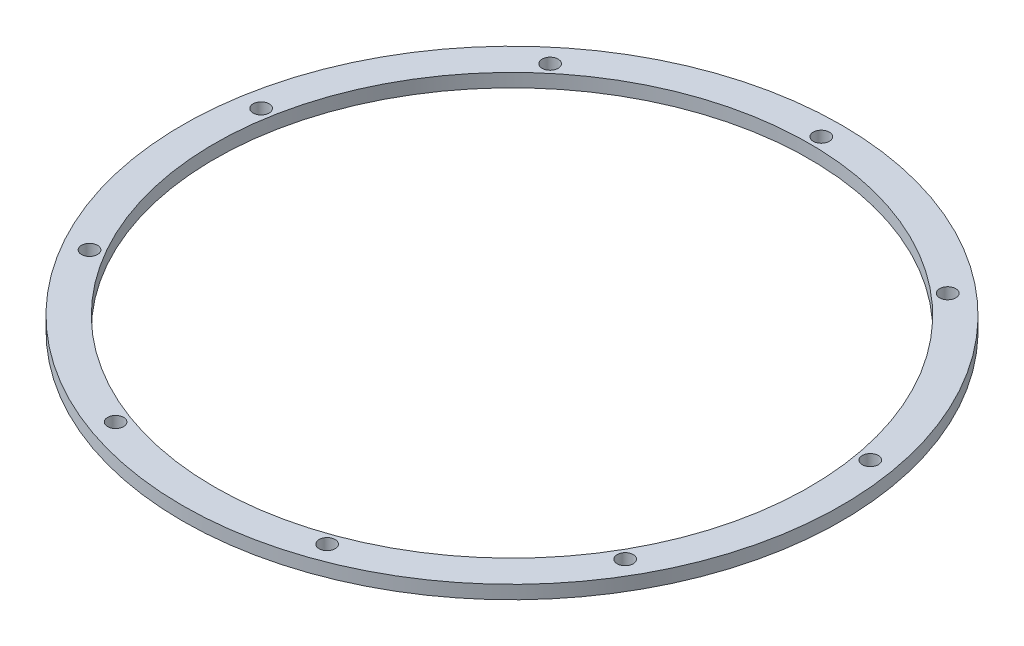
ISO-10303-21;
HEADER;
FILE_DESCRIPTION(('STEP AP214'),'2;1');
FILE_NAME('part.step','',(''),(''),'','','');
FILE_SCHEMA(('AUTOMOTIVE_DESIGN { 1 0 10303 214 1 1 1 1 }'));
ENDSEC;
DATA;
#1=APPLICATION_CONTEXT('core data for automotive mechanical design processes');
#2=APPLICATION_PROTOCOL_DEFINITION('international standard','automotive_design',2000,#1);
#3=PRODUCT_CONTEXT('',#1,'mechanical');
#4=PRODUCT('Part','Part','',(#3));
#5=PRODUCT_RELATED_PRODUCT_CATEGORY('part','',(#4));
#6=PRODUCT_DEFINITION_FORMATION('','',#4);
#7=PRODUCT_DEFINITION_CONTEXT('part definition',#1,'design');
#8=PRODUCT_DEFINITION('design','',#6,#7);
#9=PRODUCT_DEFINITION_SHAPE('','',#8);
#10=(LENGTH_UNIT() NAMED_UNIT(*) SI_UNIT(.MILLI.,.METRE.));
#11=(NAMED_UNIT(*) PLANE_ANGLE_UNIT() SI_UNIT($,.RADIAN.));
#12=(NAMED_UNIT(*) SI_UNIT($,.STERADIAN.) SOLID_ANGLE_UNIT());
#13=UNCERTAINTY_MEASURE_WITH_UNIT(LENGTH_MEASURE(1.E-05),#10,'distance_accuracy_value','');
#14=(GEOMETRIC_REPRESENTATION_CONTEXT(3) GLOBAL_UNCERTAINTY_ASSIGNED_CONTEXT((#13)) GLOBAL_UNIT_ASSIGNED_CONTEXT((#10,
#11,#12)) REPRESENTATION_CONTEXT('',''));
#15=CARTESIAN_POINT('',(0.,0.,0.));
#16=DIRECTION('',(0.,0.,1.));
#17=DIRECTION('',(1.,0.,0.));
#18=AXIS2_PLACEMENT_3D('',#15,#16,#17);
#19=CARTESIAN_POINT('',(0.,5.,0.));
#20=DIRECTION('',(0.,1.,0.));
#21=DIRECTION('',(0.,0.,1.));
#22=AXIS2_PLACEMENT_3D('',#19,#20,#21);
#23=PLANE('',#22);
#24=CARTESIAN_POINT('',(-113.745295472906,5.,-20.0563645205256));
#25=DIRECTION('',(0.,1.,0.));
#26=DIRECTION('',(0.,0.,1.));
#27=AXIS2_PLACEMENT_3D('',#24,#25,#26);
#28=CIRCLE('',#27,3.00000000000647);
#29=CARTESIAN_POINT('',(-113.745295472906,5.,-17.0563645205191));
#30=VERTEX_POINT('',#29);
#31=EDGE_CURVE('E102',#30,#30,#28,.T.);
#32=ORIENTED_EDGE('',*,*,#31,.F.);
#33=EDGE_LOOP('',(#32));
#34=FACE_BOUND('',#33,.T.);
#35=CARTESIAN_POINT('',(-39.5033265541052,5.,108.534497700774));
#36=DIRECTION('',(0.,1.,0.));
#37=DIRECTION('',(0.,0.,1.));
#38=AXIS2_PLACEMENT_3D('',#35,#36,#37);
#39=CIRCLE('',#38,3.00000000001042);
#40=CARTESIAN_POINT('',(-39.5033265541052,5.,111.534497700785));
#41=VERTEX_POINT('',#40);
#42=EDGE_CURVE('E90',#41,#41,#39,.T.);
#43=ORIENTED_EDGE('',*,*,#42,.F.);
#44=EDGE_LOOP('',(#43));
#45=FACE_BOUND('',#44,.T.);
#46=CARTESIAN_POINT('',(100.02593413711,5.,57.7499999999957));
#47=DIRECTION('',(0.,1.,0.));
#48=DIRECTION('',(0.,0.,1.));
#49=AXIS2_PLACEMENT_3D('',#46,#47,#48);
#50=CIRCLE('',#49,3.00000000000633);
#51=CARTESIAN_POINT('',(100.02593413711,5.,60.7500000000021));
#52=VERTEX_POINT('',#51);
#53=EDGE_CURVE('E78',#52,#52,#50,.T.);
#54=ORIENTED_EDGE('',*,*,#53,.F.);
#55=EDGE_LOOP('',(#54));
#56=FACE_BOUND('',#55,.T.);
#57=CARTESIAN_POINT('',(74.2419689187964,5.,-88.4781331802451));
#58=DIRECTION('',(0.,1.,0.));
#59=DIRECTION('',(0.,0.,1.));
#60=AXIS2_PLACEMENT_3D('',#57,#58,#59);
#61=CIRCLE('',#60,3.00000000000036);
#62=CARTESIAN_POINT('',(74.2419689187964,5.,-85.4781331802448));
#63=VERTEX_POINT('',#62);
#64=EDGE_CURVE('E66',#63,#63,#61,.T.);
#65=ORIENTED_EDGE('',*,*,#64,.F.);
#66=EDGE_LOOP('',(#65));
#67=FACE_BOUND('',#66,.T.);
#68=CARTESIAN_POINT('',(0.,5.,0.));
#69=DIRECTION('',(0.,1.,0.));
#70=DIRECTION('',(0.,0.,1.));
#71=AXIS2_PLACEMENT_3D('',#68,#69,#70);
#72=CIRCLE('',#71,111.1);
#73=CARTESIAN_POINT('',(0.,5.,111.1));
#74=VERTEX_POINT('',#73);
#75=EDGE_CURVE('E55',#74,#74,#72,.T.);
#76=ORIENTED_EDGE('',*,*,#75,.F.);
#77=EDGE_LOOP('',(#76));
#78=FACE_BOUND('',#77,.T.);
#79=CARTESIAN_POINT('',(0.,5.,0.));
#80=DIRECTION('',(0.,1.,0.));
#81=DIRECTION('',(0.,0.,1.));
#82=AXIS2_PLACEMENT_3D('',#79,#80,#81);
#83=CIRCLE('',#82,123.075);
#84=CARTESIAN_POINT('',(0.,5.,123.075));
#85=VERTEX_POINT('',#84);
#86=EDGE_CURVE('E12',#85,#85,#83,.T.);
#87=ORIENTED_EDGE('',*,*,#86,.T.);
#88=EDGE_LOOP('',(#87));
#89=FACE_BOUND('',#88,.T.);
#90=CARTESIAN_POINT('',(0.,5.,-115.5));
#91=DIRECTION('',(0.,1.,0.));
#92=DIRECTION('',(0.,0.,1.));
#93=AXIS2_PLACEMENT_3D('',#90,#91,#92);
#94=CIRCLE('',#93,3.);
#95=CARTESIAN_POINT('',(0.,5.,-112.5));
#96=VERTEX_POINT('',#95);
#97=EDGE_CURVE('E60',#96,#96,#94,.T.);
#98=ORIENTED_EDGE('',*,*,#97,.F.);
#99=EDGE_LOOP('',(#98));
#100=FACE_BOUND('',#99,.T.);
#101=CARTESIAN_POINT('',(113.745295472914,5.,-20.0563645205353));
#102=DIRECTION('',(0.,1.,0.));
#103=DIRECTION('',(0.,0.,1.));
#104=AXIS2_PLACEMENT_3D('',#101,#102,#103);
#105=CIRCLE('',#104,3.00000000000281);
#106=CARTESIAN_POINT('',(113.745295472914,5.,-17.0563645205325));
#107=VERTEX_POINT('',#106);
#108=EDGE_CURVE('E72',#107,#107,#105,.T.);
#109=ORIENTED_EDGE('',*,*,#108,.F.);
#110=EDGE_LOOP('',(#109));
#111=FACE_BOUND('',#110,.T.);
#112=CARTESIAN_POINT('',(39.5033265541243,5.,108.534497700771));
#113=DIRECTION('',(0.,1.,0.));
#114=DIRECTION('',(0.,0.,1.));
#115=AXIS2_PLACEMENT_3D('',#112,#113,#114);
#116=CIRCLE('',#115,3.0000000000093);
#117=CARTESIAN_POINT('',(39.5033265541243,5.,111.53449770078));
#118=VERTEX_POINT('',#117);
#119=EDGE_CURVE('E84',#118,#118,#116,.T.);
#120=ORIENTED_EDGE('',*,*,#119,.F.);
#121=EDGE_LOOP('',(#120));
#122=FACE_BOUND('',#121,.T.);
#123=CARTESIAN_POINT('',(-100.025934137095,5.,57.7500000000043));
#124=DIRECTION('',(0.,1.,0.));
#125=DIRECTION('',(0.,0.,1.));
#126=AXIS2_PLACEMENT_3D('',#123,#124,#125);
#127=CIRCLE('',#126,3.00000000000937);
#128=CARTESIAN_POINT('',(-100.025934137095,5.,60.7500000000137));
#129=VERTEX_POINT('',#128);
#130=EDGE_CURVE('E96',#129,#129,#127,.T.);
#131=ORIENTED_EDGE('',*,*,#130,.F.);
#132=EDGE_LOOP('',(#131));
#133=FACE_BOUND('',#132,.T.);
#134=CARTESIAN_POINT('',(-74.2419689187942,5.,-88.4781331802388));
#135=DIRECTION('',(0.,1.,0.));
#136=DIRECTION('',(0.,0.,1.));
#137=AXIS2_PLACEMENT_3D('',#134,#135,#136);
#138=CIRCLE('',#137,3.00000000000341);
#139=CARTESIAN_POINT('',(-74.2419689187942,5.,-85.4781331802354));
#140=VERTEX_POINT('',#139);
#141=EDGE_CURVE('E108',#140,#140,#138,.T.);
#142=ORIENTED_EDGE('',*,*,#141,.F.);
#143=EDGE_LOOP('',(#142));
#144=FACE_BOUND('',#143,.T.);
#145=ADVANCED_FACE('F44',(#34,#45,#56,#67,#78,#89,#100,#111,#122,#133,#144),#23,.T.);
#146=CARTESIAN_POINT('',(0.,0.,0.));
#147=DIRECTION('',(0.,1.,0.));
#148=DIRECTION('',(0.,0.,1.));
#149=AXIS2_PLACEMENT_3D('',#146,#147,#148);
#150=PLANE('',#149);
#151=CARTESIAN_POINT('',(0.,0.,0.));
#152=DIRECTION('',(0.,1.,0.));
#153=DIRECTION('',(0.,0.,1.));
#154=AXIS2_PLACEMENT_3D('',#151,#152,#153);
#155=CIRCLE('',#154,123.075);
#156=CARTESIAN_POINT('',(0.,0.,123.075));
#157=VERTEX_POINT('',#156);
#158=EDGE_CURVE('E48',#157,#157,#155,.T.);
#159=ORIENTED_EDGE('',*,*,#158,.F.);
#160=EDGE_LOOP('',(#159));
#161=FACE_BOUND('',#160,.T.);
#162=CARTESIAN_POINT('',(0.,0.,0.));
#163=DIRECTION('',(0.,1.,0.));
#164=DIRECTION('',(0.,0.,1.));
#165=AXIS2_PLACEMENT_3D('',#162,#163,#164);
#166=CIRCLE('',#165,111.1);
#167=CARTESIAN_POINT('',(0.,0.,111.1));
#168=VERTEX_POINT('',#167);
#169=EDGE_CURVE('E57',#168,#168,#166,.T.);
#170=ORIENTED_EDGE('',*,*,#169,.T.);
#171=EDGE_LOOP('',(#170));
#172=FACE_BOUND('',#171,.T.);
#173=CARTESIAN_POINT('',(0.,0.,-115.5));
#174=DIRECTION('',(0.,1.,0.));
#175=DIRECTION('',(0.,0.,1.));
#176=AXIS2_PLACEMENT_3D('',#173,#174,#175);
#177=CIRCLE('',#176,3.);
#178=CARTESIAN_POINT('',(0.,0.,-112.5));
#179=VERTEX_POINT('',#178);
#180=EDGE_CURVE('E63',#179,#179,#177,.T.);
#181=ORIENTED_EDGE('',*,*,#180,.T.);
#182=EDGE_LOOP('',(#181));
#183=FACE_BOUND('',#182,.T.);
#184=CARTESIAN_POINT('',(74.2419689187964,0.,-88.4781331802451));
#185=DIRECTION('',(0.,1.,0.));
#186=DIRECTION('',(0.,0.,1.));
#187=AXIS2_PLACEMENT_3D('',#184,#185,#186);
#188=CIRCLE('',#187,3.00000000000036);
#189=CARTESIAN_POINT('',(74.2419689187964,0.,-85.4781331802448));
#190=VERTEX_POINT('',#189);
#191=EDGE_CURVE('E69',#190,#190,#188,.T.);
#192=ORIENTED_EDGE('',*,*,#191,.T.);
#193=EDGE_LOOP('',(#192));
#194=FACE_BOUND('',#193,.T.);
#195=CARTESIAN_POINT('',(113.745295472914,0.,-20.0563645205353));
#196=DIRECTION('',(0.,1.,0.));
#197=DIRECTION('',(0.,0.,1.));
#198=AXIS2_PLACEMENT_3D('',#195,#196,#197);
#199=CIRCLE('',#198,3.00000000000281);
#200=CARTESIAN_POINT('',(113.745295472914,0.,-17.0563645205325));
#201=VERTEX_POINT('',#200);
#202=EDGE_CURVE('E75',#201,#201,#199,.T.);
#203=ORIENTED_EDGE('',*,*,#202,.T.);
#204=EDGE_LOOP('',(#203));
#205=FACE_BOUND('',#204,.T.);
#206=CARTESIAN_POINT('',(100.02593413711,0.,57.7499999999957));
#207=DIRECTION('',(0.,1.,0.));
#208=DIRECTION('',(0.,0.,1.));
#209=AXIS2_PLACEMENT_3D('',#206,#207,#208);
#210=CIRCLE('',#209,3.00000000000633);
#211=CARTESIAN_POINT('',(100.02593413711,0.,60.7500000000021));
#212=VERTEX_POINT('',#211);
#213=EDGE_CURVE('E81',#212,#212,#210,.T.);
#214=ORIENTED_EDGE('',*,*,#213,.T.);
#215=EDGE_LOOP('',(#214));
#216=FACE_BOUND('',#215,.T.);
#217=CARTESIAN_POINT('',(39.5033265541243,0.,108.534497700771));
#218=DIRECTION('',(0.,1.,0.));
#219=DIRECTION('',(0.,0.,1.));
#220=AXIS2_PLACEMENT_3D('',#217,#218,#219);
#221=CIRCLE('',#220,3.0000000000093);
#222=CARTESIAN_POINT('',(39.5033265541243,0.,111.53449770078));
#223=VERTEX_POINT('',#222);
#224=EDGE_CURVE('E87',#223,#223,#221,.T.);
#225=ORIENTED_EDGE('',*,*,#224,.T.);
#226=EDGE_LOOP('',(#225));
#227=FACE_BOUND('',#226,.T.);
#228=CARTESIAN_POINT('',(-39.5033265541052,0.,108.534497700774));
#229=DIRECTION('',(0.,1.,0.));
#230=DIRECTION('',(0.,0.,1.));
#231=AXIS2_PLACEMENT_3D('',#228,#229,#230);
#232=CIRCLE('',#231,3.00000000001042);
#233=CARTESIAN_POINT('',(-39.5033265541052,0.,111.534497700785));
#234=VERTEX_POINT('',#233);
#235=EDGE_CURVE('E93',#234,#234,#232,.T.);
#236=ORIENTED_EDGE('',*,*,#235,.T.);
#237=EDGE_LOOP('',(#236));
#238=FACE_BOUND('',#237,.T.);
#239=CARTESIAN_POINT('',(-100.025934137095,0.,57.7500000000043));
#240=DIRECTION('',(0.,1.,0.));
#241=DIRECTION('',(0.,0.,1.));
#242=AXIS2_PLACEMENT_3D('',#239,#240,#241);
#243=CIRCLE('',#242,3.00000000000937);
#244=CARTESIAN_POINT('',(-100.025934137095,0.,60.7500000000137));
#245=VERTEX_POINT('',#244);
#246=EDGE_CURVE('E99',#245,#245,#243,.T.);
#247=ORIENTED_EDGE('',*,*,#246,.T.);
#248=EDGE_LOOP('',(#247));
#249=FACE_BOUND('',#248,.T.);
#250=CARTESIAN_POINT('',(-113.745295472906,0.,-20.0563645205256));
#251=DIRECTION('',(0.,1.,0.));
#252=DIRECTION('',(0.,0.,1.));
#253=AXIS2_PLACEMENT_3D('',#250,#251,#252);
#254=CIRCLE('',#253,3.00000000000647);
#255=CARTESIAN_POINT('',(-113.745295472906,0.,-17.0563645205191));
#256=VERTEX_POINT('',#255);
#257=EDGE_CURVE('E105',#256,#256,#254,.T.);
#258=ORIENTED_EDGE('',*,*,#257,.T.);
#259=EDGE_LOOP('',(#258));
#260=FACE_BOUND('',#259,.T.);
#261=CARTESIAN_POINT('',(-74.2419689187942,0.,-88.4781331802388));
#262=DIRECTION('',(0.,1.,0.));
#263=DIRECTION('',(0.,0.,1.));
#264=AXIS2_PLACEMENT_3D('',#261,#262,#263);
#265=CIRCLE('',#264,3.00000000000341);
#266=CARTESIAN_POINT('',(-74.2419689187942,0.,-85.4781331802354));
#267=VERTEX_POINT('',#266);
#268=EDGE_CURVE('E111',#267,#267,#265,.T.);
#269=ORIENTED_EDGE('',*,*,#268,.T.);
#270=EDGE_LOOP('',(#269));
#271=FACE_BOUND('',#270,.T.);
#272=ADVANCED_FACE('F121',(#161,#172,#183,#194,#205,#216,#227,#238,#249,#260,#271),#150,.F.);
#273=CARTESIAN_POINT('',(0.,5.,0.));
#274=DIRECTION('',(0.,-1.,0.));
#275=DIRECTION('',(0.,0.,-1.));
#276=AXIS2_PLACEMENT_3D('',#273,#274,#275);
#277=CYLINDRICAL_SURFACE('',#276,123.075);
#278=ORIENTED_EDGE('',*,*,#86,.F.);
#279=EDGE_LOOP('',(#278));
#280=FACE_BOUND('',#279,.T.);
#281=ORIENTED_EDGE('',*,*,#158,.T.);
#282=EDGE_LOOP('',(#281));
#283=FACE_BOUND('',#282,.T.);
#284=ADVANCED_FACE('F46',(#280,#283),#277,.T.);
#285=CARTESIAN_POINT('',(0.,5.,0.));
#286=DIRECTION('',(0.,-1.,0.));
#287=DIRECTION('',(0.,0.,-1.));
#288=AXIS2_PLACEMENT_3D('',#285,#286,#287);
#289=CYLINDRICAL_SURFACE('',#288,111.1);
#290=ORIENTED_EDGE('',*,*,#75,.T.);
#291=EDGE_LOOP('',(#290));
#292=FACE_BOUND('',#291,.T.);
#293=ORIENTED_EDGE('',*,*,#169,.F.);
#294=EDGE_LOOP('',(#293));
#295=FACE_BOUND('',#294,.T.);
#296=ADVANCED_FACE('F131',(#292,#295),#289,.F.);
#297=CARTESIAN_POINT('',(0.,5.,-115.5));
#298=DIRECTION('',(0.,-1.,0.));
#299=DIRECTION('',(0.,0.,-1.));
#300=AXIS2_PLACEMENT_3D('',#297,#298,#299);
#301=CYLINDRICAL_SURFACE('',#300,3.);
#302=ORIENTED_EDGE('',*,*,#97,.T.);
#303=EDGE_LOOP('',(#302));
#304=FACE_BOUND('',#303,.T.);
#305=ORIENTED_EDGE('',*,*,#180,.F.);
#306=EDGE_LOOP('',(#305));
#307=FACE_BOUND('',#306,.T.);
#308=ADVANCED_FACE('F134',(#304,#307),#301,.F.);
#309=CARTESIAN_POINT('',(74.2419689187964,5.,-88.4781331802451));
#310=DIRECTION('',(0.,-1.,0.));
#311=DIRECTION('',(0.,0.,-1.));
#312=AXIS2_PLACEMENT_3D('',#309,#310,#311);
#313=CYLINDRICAL_SURFACE('',#312,3.00000000000036);
#314=ORIENTED_EDGE('',*,*,#64,.T.);
#315=EDGE_LOOP('',(#314));
#316=FACE_BOUND('',#315,.T.);
#317=ORIENTED_EDGE('',*,*,#191,.F.);
#318=EDGE_LOOP('',(#317));
#319=FACE_BOUND('',#318,.T.);
#320=ADVANCED_FACE('F138',(#316,#319),#313,.F.);
#321=CARTESIAN_POINT('',(113.745295472914,5.,-20.0563645205353));
#322=DIRECTION('',(0.,-1.,0.));
#323=DIRECTION('',(0.,0.,-1.));
#324=AXIS2_PLACEMENT_3D('',#321,#322,#323);
#325=CYLINDRICAL_SURFACE('',#324,3.00000000000281);
#326=ORIENTED_EDGE('',*,*,#108,.T.);
#327=EDGE_LOOP('',(#326));
#328=FACE_BOUND('',#327,.T.);
#329=ORIENTED_EDGE('',*,*,#202,.F.);
#330=EDGE_LOOP('',(#329));
#331=FACE_BOUND('',#330,.T.);
#332=ADVANCED_FACE('F142',(#328,#331),#325,.F.);
#333=CARTESIAN_POINT('',(100.02593413711,5.,57.7499999999957));
#334=DIRECTION('',(0.,-1.,0.));
#335=DIRECTION('',(0.,0.,-1.));
#336=AXIS2_PLACEMENT_3D('',#333,#334,#335);
#337=CYLINDRICAL_SURFACE('',#336,3.00000000000633);
#338=ORIENTED_EDGE('',*,*,#53,.T.);
#339=EDGE_LOOP('',(#338));
#340=FACE_BOUND('',#339,.T.);
#341=ORIENTED_EDGE('',*,*,#213,.F.);
#342=EDGE_LOOP('',(#341));
#343=FACE_BOUND('',#342,.T.);
#344=ADVANCED_FACE('F146',(#340,#343),#337,.F.);
#345=CARTESIAN_POINT('',(39.5033265541243,5.,108.534497700771));
#346=DIRECTION('',(0.,-1.,0.));
#347=DIRECTION('',(0.,0.,-1.));
#348=AXIS2_PLACEMENT_3D('',#345,#346,#347);
#349=CYLINDRICAL_SURFACE('',#348,3.0000000000093);
#350=ORIENTED_EDGE('',*,*,#119,.T.);
#351=EDGE_LOOP('',(#350));
#352=FACE_BOUND('',#351,.T.);
#353=ORIENTED_EDGE('',*,*,#224,.F.);
#354=EDGE_LOOP('',(#353));
#355=FACE_BOUND('',#354,.T.);
#356=ADVANCED_FACE('F150',(#352,#355),#349,.F.);
#357=CARTESIAN_POINT('',(-39.5033265541052,5.,108.534497700774));
#358=DIRECTION('',(0.,-1.,0.));
#359=DIRECTION('',(0.,0.,-1.));
#360=AXIS2_PLACEMENT_3D('',#357,#358,#359);
#361=CYLINDRICAL_SURFACE('',#360,3.00000000001042);
#362=ORIENTED_EDGE('',*,*,#42,.T.);
#363=EDGE_LOOP('',(#362));
#364=FACE_BOUND('',#363,.T.);
#365=ORIENTED_EDGE('',*,*,#235,.F.);
#366=EDGE_LOOP('',(#365));
#367=FACE_BOUND('',#366,.T.);
#368=ADVANCED_FACE('F154',(#364,#367),#361,.F.);
#369=CARTESIAN_POINT('',(-100.025934137095,5.,57.7500000000043));
#370=DIRECTION('',(0.,-1.,0.));
#371=DIRECTION('',(0.,0.,-1.));
#372=AXIS2_PLACEMENT_3D('',#369,#370,#371);
#373=CYLINDRICAL_SURFACE('',#372,3.00000000000937);
#374=ORIENTED_EDGE('',*,*,#130,.T.);
#375=EDGE_LOOP('',(#374));
#376=FACE_BOUND('',#375,.T.);
#377=ORIENTED_EDGE('',*,*,#246,.F.);
#378=EDGE_LOOP('',(#377));
#379=FACE_BOUND('',#378,.T.);
#380=ADVANCED_FACE('F158',(#376,#379),#373,.F.);
#381=CARTESIAN_POINT('',(-113.745295472906,5.,-20.0563645205256));
#382=DIRECTION('',(0.,-1.,0.));
#383=DIRECTION('',(0.,0.,-1.));
#384=AXIS2_PLACEMENT_3D('',#381,#382,#383);
#385=CYLINDRICAL_SURFACE('',#384,3.00000000000647);
#386=ORIENTED_EDGE('',*,*,#31,.T.);
#387=EDGE_LOOP('',(#386));
#388=FACE_BOUND('',#387,.T.);
#389=ORIENTED_EDGE('',*,*,#257,.F.);
#390=EDGE_LOOP('',(#389));
#391=FACE_BOUND('',#390,.T.);
#392=ADVANCED_FACE('F162',(#388,#391),#385,.F.);
#393=CARTESIAN_POINT('',(-74.2419689187942,5.,-88.4781331802388));
#394=DIRECTION('',(0.,-1.,0.));
#395=DIRECTION('',(0.,0.,-1.));
#396=AXIS2_PLACEMENT_3D('',#393,#394,#395);
#397=CYLINDRICAL_SURFACE('',#396,3.00000000000341);
#398=ORIENTED_EDGE('',*,*,#141,.T.);
#399=EDGE_LOOP('',(#398));
#400=FACE_BOUND('',#399,.T.);
#401=ORIENTED_EDGE('',*,*,#268,.F.);
#402=EDGE_LOOP('',(#401));
#403=FACE_BOUND('',#402,.T.);
#404=ADVANCED_FACE('F117',(#400,#403),#397,.F.);
#405=CLOSED_SHELL('',(#145,#272,#284,#296,#308,#320,#332,#344,#356,#368,#380,#392,#404));
#406=MANIFOLD_SOLID_BREP('B2',#405);
#407=ADVANCED_BREP_SHAPE_REPRESENTATION('',(#18,#406),#14);
#408=SHAPE_DEFINITION_REPRESENTATION(#9,#407);
ENDSEC;
END-ISO-10303-21;
